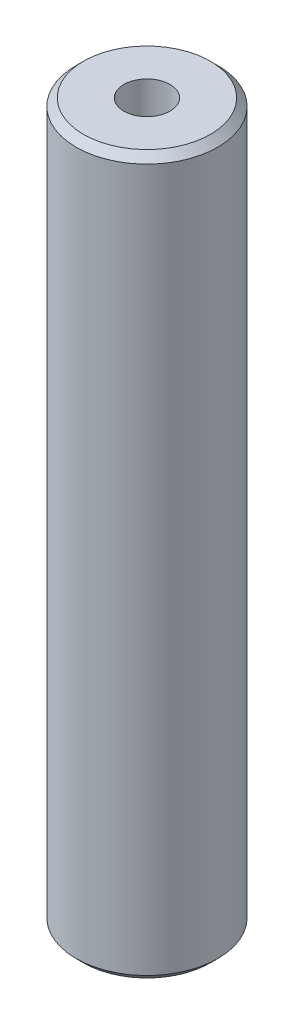
ISO-10303-21;
HEADER;
FILE_DESCRIPTION(('STEP AP214'),'2;1');
FILE_NAME('part.step','',(''),(''),'','','');
FILE_SCHEMA(('AUTOMOTIVE_DESIGN { 1 0 10303 214 1 1 1 1 }'));
ENDSEC;
DATA;
#1=APPLICATION_CONTEXT('core data for automotive mechanical design processes');
#2=APPLICATION_PROTOCOL_DEFINITION('international standard','automotive_design',2000,#1);
#3=PRODUCT_CONTEXT('',#1,'mechanical');
#4=PRODUCT('Part','Part','',(#3));
#5=PRODUCT_RELATED_PRODUCT_CATEGORY('part','',(#4));
#6=PRODUCT_DEFINITION_FORMATION('','',#4);
#7=PRODUCT_DEFINITION_CONTEXT('part definition',#1,'design');
#8=PRODUCT_DEFINITION('design','',#6,#7);
#9=PRODUCT_DEFINITION_SHAPE('','',#8);
#10=(LENGTH_UNIT() NAMED_UNIT(*) SI_UNIT(.MILLI.,.METRE.));
#11=(NAMED_UNIT(*) PLANE_ANGLE_UNIT() SI_UNIT($,.RADIAN.));
#12=(NAMED_UNIT(*) SI_UNIT($,.STERADIAN.) SOLID_ANGLE_UNIT());
#13=UNCERTAINTY_MEASURE_WITH_UNIT(LENGTH_MEASURE(1.E-05),#10,'distance_accuracy_value','');
#14=(GEOMETRIC_REPRESENTATION_CONTEXT(3) GLOBAL_UNCERTAINTY_ASSIGNED_CONTEXT((#13)) GLOBAL_UNIT_ASSIGNED_CONTEXT((#10,
#11,#12)) REPRESENTATION_CONTEXT('',''));
#15=CARTESIAN_POINT('',(0.,0.,0.));
#16=DIRECTION('',(0.,0.,1.));
#17=DIRECTION('',(1.,0.,0.));
#18=AXIS2_PLACEMENT_3D('',#15,#16,#17);
#19=CARTESIAN_POINT('',(0.,430.487549459525,0.));
#20=DIRECTION('',(0.,-1.,0.));
#21=DIRECTION('',(0.,0.,-1.));
#22=AXIS2_PLACEMENT_3D('',#19,#20,#21);
#23=CYLINDRICAL_SURFACE('',#22,42.5);
#24=CARTESIAN_POINT('',(0.,426.049121845294,0.));
#25=DIRECTION('',(0.,1.,0.));
#26=DIRECTION('',(0.,0.,1.));
#27=AXIS2_PLACEMENT_3D('',#24,#25,#26);
#28=CIRCLE('',#27,42.5);
#29=CARTESIAN_POINT('',(0.,426.049121845294,42.5));
#30=VERTEX_POINT('',#29);
#31=EDGE_CURVE('E50',#30,#30,#28,.F.);
#32=ORIENTED_EDGE('',*,*,#31,.T.);
#33=EDGE_LOOP('',(#32));
#34=FACE_BOUND('',#33,.T.);
#35=CARTESIAN_POINT('',(0.,4.43842761423102,0.));
#36=DIRECTION('',(0.,1.,0.));
#37=DIRECTION('',(0.,0.,1.));
#38=AXIS2_PLACEMENT_3D('',#35,#36,#37);
#39=CIRCLE('',#38,42.5);
#40=CARTESIAN_POINT('',(0.,4.43842761423102,42.5));
#41=VERTEX_POINT('',#40);
#42=EDGE_CURVE('E51',#41,#41,#39,.T.);
#43=ORIENTED_EDGE('',*,*,#42,.T.);
#44=EDGE_LOOP('',(#43));
#45=FACE_BOUND('',#44,.T.);
#46=ADVANCED_FACE('F39',(#34,#45),#23,.T.);
#47=CARTESIAN_POINT('',(0.,430.487549459525,0.));
#48=DIRECTION('',(0.,1.,0.));
#49=DIRECTION('',(0.,0.,1.));
#50=AXIS2_PLACEMENT_3D('',#47,#48,#49);
#51=PLANE('',#50);
#52=CARTESIAN_POINT('',(0.,430.487549459525,0.));
#53=DIRECTION('',(0.,1.,0.));
#54=DIRECTION('',(0.,0.,1.));
#55=AXIS2_PLACEMENT_3D('',#52,#53,#54);
#56=CIRCLE('',#55,38.061572385769);
#57=CARTESIAN_POINT('',(0.,430.487549459525,38.061572385769));
#58=VERTEX_POINT('',#57);
#59=EDGE_CURVE('E54',#58,#58,#56,.T.);
#60=ORIENTED_EDGE('',*,*,#59,.T.);
#61=EDGE_LOOP('',(#60));
#62=FACE_BOUND('',#61,.T.);
#63=CARTESIAN_POINT('',(0.,430.487549459525,0.));
#64=DIRECTION('',(0.,1.,0.));
#65=DIRECTION('',(0.,0.,1.));
#66=AXIS2_PLACEMENT_3D('',#63,#64,#65);
#67=CIRCLE('',#66,13.8711278212324);
#68=CARTESIAN_POINT('',(0.,430.487549459525,13.8711278212324));
#69=VERTEX_POINT('',#68);
#70=EDGE_CURVE('E58',#69,#69,#67,.T.);
#71=ORIENTED_EDGE('',*,*,#70,.F.);
#72=EDGE_LOOP('',(#71));
#73=FACE_BOUND('',#72,.T.);
#74=ADVANCED_FACE('F69',(#62,#73),#51,.T.);
#75=CARTESIAN_POINT('',(0.,0.,0.));
#76=DIRECTION('',(0.,1.,0.));
#77=DIRECTION('',(0.,0.,1.));
#78=AXIS2_PLACEMENT_3D('',#75,#76,#77);
#79=PLANE('',#78);
#80=CARTESIAN_POINT('',(0.,0.,0.));
#81=DIRECTION('',(0.,1.,0.));
#82=DIRECTION('',(0.,0.,1.));
#83=AXIS2_PLACEMENT_3D('',#80,#81,#82);
#84=CIRCLE('',#83,38.0615723857689);
#85=CARTESIAN_POINT('',(0.,0.,38.0615723857689));
#86=VERTEX_POINT('',#85);
#87=EDGE_CURVE('E10',#86,#86,#84,.F.);
#88=ORIENTED_EDGE('',*,*,#87,.T.);
#89=EDGE_LOOP('',(#88));
#90=FACE_BOUND('',#89,.T.);
#91=CARTESIAN_POINT('',(0.,0.,0.));
#92=DIRECTION('',(0.,1.,0.));
#93=DIRECTION('',(0.,0.,1.));
#94=AXIS2_PLACEMENT_3D('',#91,#92,#93);
#95=CIRCLE('',#94,13.8711278212324);
#96=CARTESIAN_POINT('',(0.,0.,13.8711278212324));
#97=VERTEX_POINT('',#96);
#98=EDGE_CURVE('E63',#97,#97,#95,.T.);
#99=ORIENTED_EDGE('',*,*,#98,.T.);
#100=EDGE_LOOP('',(#99));
#101=FACE_BOUND('',#100,.T.);
#102=ADVANCED_FACE('F75',(#90,#101),#79,.F.);
#103=CARTESIAN_POINT('',(0.,430.487549459525,0.));
#104=DIRECTION('',(0.,-1.,0.));
#105=DIRECTION('',(0.,0.,-1.));
#106=AXIS2_PLACEMENT_3D('',#103,#104,#105);
#107=CYLINDRICAL_SURFACE('',#106,13.8711278212324);
#108=ORIENTED_EDGE('',*,*,#70,.T.);
#109=EDGE_LOOP('',(#108));
#110=FACE_BOUND('',#109,.T.);
#111=ORIENTED_EDGE('',*,*,#98,.F.);
#112=EDGE_LOOP('',(#111));
#113=FACE_BOUND('',#112,.T.);
#114=ADVANCED_FACE('F70',(#110,#113),#107,.F.);
#115=CARTESIAN_POINT('',(0.,430.487549459525,0.));
#116=DIRECTION('',(0.,-1.,0.));
#117=DIRECTION('',(0.,0.,-1.));
#118=AXIS2_PLACEMENT_3D('',#115,#116,#117);
#119=CONICAL_SURFACE('',#118,38.061572385769,0.785398163397451);
#120=ORIENTED_EDGE('',*,*,#31,.F.);
#121=EDGE_LOOP('',(#120));
#122=FACE_BOUND('',#121,.T.);
#123=ORIENTED_EDGE('',*,*,#59,.F.);
#124=EDGE_LOOP('',(#123));
#125=FACE_BOUND('',#124,.T.);
#126=ADVANCED_FACE('F81',(#122,#125),#119,.T.);
#127=CARTESIAN_POINT('',(0.,4.43842761423102,0.));
#128=DIRECTION('',(0.,1.,0.));
#129=DIRECTION('',(0.,0.,1.));
#130=AXIS2_PLACEMENT_3D('',#127,#128,#129);
#131=CONICAL_SURFACE('',#130,42.5,0.785398163397458);
#132=ORIENTED_EDGE('',*,*,#87,.F.);
#133=EDGE_LOOP('',(#132));
#134=FACE_BOUND('',#133,.T.);
#135=ORIENTED_EDGE('',*,*,#42,.F.);
#136=EDGE_LOOP('',(#135));
#137=FACE_BOUND('',#136,.T.);
#138=ADVANCED_FACE('F45',(#134,#137),#131,.T.);
#139=CLOSED_SHELL('',(#46,#74,#102,#114,#126,#138));
#140=MANIFOLD_SOLID_BREP('B2',#139);
#141=ADVANCED_BREP_SHAPE_REPRESENTATION('',(#18,#140),#14);
#142=SHAPE_DEFINITION_REPRESENTATION(#9,#141);
ENDSEC;
END-ISO-10303-21;
